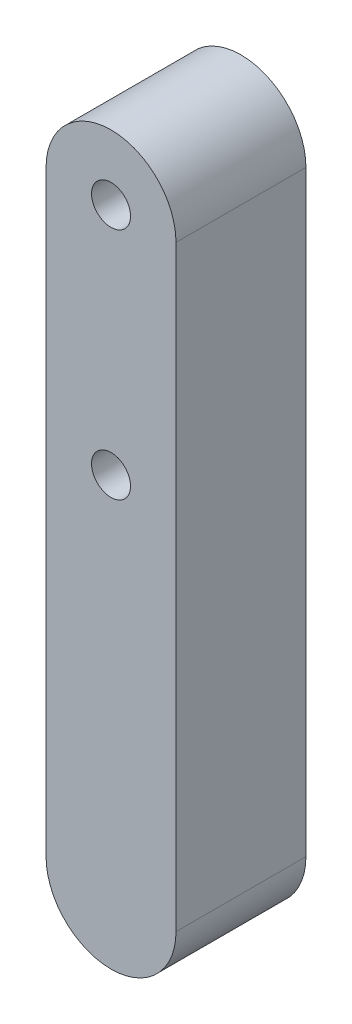
ISO-10303-21;
HEADER;
FILE_DESCRIPTION(('STEP AP214'),'2;1');
FILE_NAME('part.step','',(''),(''),'','','');
FILE_SCHEMA(('AUTOMOTIVE_DESIGN { 1 0 10303 214 1 1 1 1 }'));
ENDSEC;
DATA;
#1=APPLICATION_CONTEXT('core data for automotive mechanical design processes');
#2=APPLICATION_PROTOCOL_DEFINITION('international standard','automotive_design',2000,#1);
#3=PRODUCT_CONTEXT('',#1,'mechanical');
#4=PRODUCT('Part','Part','',(#3));
#5=PRODUCT_RELATED_PRODUCT_CATEGORY('part','',(#4));
#6=PRODUCT_DEFINITION_FORMATION('','',#4);
#7=PRODUCT_DEFINITION_CONTEXT('part definition',#1,'design');
#8=PRODUCT_DEFINITION('design','',#6,#7);
#9=PRODUCT_DEFINITION_SHAPE('','',#8);
#10=(LENGTH_UNIT() NAMED_UNIT(*) SI_UNIT(.MILLI.,.METRE.));
#11=(NAMED_UNIT(*) PLANE_ANGLE_UNIT() SI_UNIT($,.RADIAN.));
#12=(NAMED_UNIT(*) SI_UNIT($,.STERADIAN.) SOLID_ANGLE_UNIT());
#13=UNCERTAINTY_MEASURE_WITH_UNIT(LENGTH_MEASURE(1.E-05),#10,'distance_accuracy_value','');
#14=(GEOMETRIC_REPRESENTATION_CONTEXT(3) GLOBAL_UNCERTAINTY_ASSIGNED_CONTEXT((#13)) GLOBAL_UNIT_ASSIGNED_CONTEXT((#10,
#11,#12)) REPRESENTATION_CONTEXT('',''));
#15=CARTESIAN_POINT('',(0.,0.,0.));
#16=DIRECTION('',(0.,0.,1.));
#17=DIRECTION('',(1.,0.,0.));
#18=AXIS2_PLACEMENT_3D('',#15,#16,#17);
#19=CARTESIAN_POINT('',(0.,18.,-20.));
#20=DIRECTION('',(0.,0.,-1.));
#21=DIRECTION('',(-1.,0.,0.));
#22=AXIS2_PLACEMENT_3D('',#19,#20,#21);
#23=PLANE('',#22);
#24=CARTESIAN_POINT('',(0.,18.,-20.));
#25=DIRECTION('',(0.,0.,-1.));
#26=DIRECTION('',(-1.,0.,0.));
#27=AXIS2_PLACEMENT_3D('',#24,#25,#26);
#28=CIRCLE('',#27,3.);
#29=CARTESIAN_POINT('',(-2.99999999999999,18.,-20.));
#30=VERTEX_POINT('',#29);
#31=EDGE_CURVE('E99',#30,#30,#28,.T.);
#32=ORIENTED_EDGE('',*,*,#31,.F.);
#33=EDGE_LOOP('',(#32));
#34=FACE_BOUND('',#33,.T.);
#35=CARTESIAN_POINT('',(0.,18.,-20.));
#36=DIRECTION('',(0.,0.,-1.));
#37=DIRECTION('',(-1.,0.,0.));
#38=AXIS2_PLACEMENT_3D('',#35,#36,#37);
#39=CIRCLE('',#38,10.);
#40=CARTESIAN_POINT('',(-10.,18.,-20.));
#41=VERTEX_POINT('',#40);
#42=CARTESIAN_POINT('',(10.,18.,-20.));
#43=VERTEX_POINT('',#42);
#44=EDGE_CURVE('E84',#41,#43,#39,.T.);
#45=ORIENTED_EDGE('',*,*,#44,.T.);
#46=DIRECTION('',(0.,-1.,0.));
#47=VECTOR('',#46,1.);
#48=CARTESIAN_POINT('',(10.,18.,-20.));
#49=LINE('',#48,#47);
#50=CARTESIAN_POINT('',(10.,-73.8773209467205,-20.));
#51=VERTEX_POINT('',#50);
#52=EDGE_CURVE('E79',#43,#51,#49,.T.);
#53=ORIENTED_EDGE('',*,*,#52,.T.);
#54=CARTESIAN_POINT('',(0.,-73.8773209467205,-20.));
#55=DIRECTION('',(0.,0.,-1.));
#56=DIRECTION('',(-1.,0.,0.));
#57=AXIS2_PLACEMENT_3D('',#54,#55,#56);
#58=CIRCLE('',#57,10.);
#59=CARTESIAN_POINT('',(-10.,-73.8773209467205,-20.));
#60=VERTEX_POINT('',#59);
#61=EDGE_CURVE('E82',#51,#60,#58,.T.);
#62=ORIENTED_EDGE('',*,*,#61,.T.);
#63=DIRECTION('',(0.,1.,0.));
#64=VECTOR('',#63,1.);
#65=CARTESIAN_POINT('',(-10.,18.,-20.));
#66=LINE('',#65,#64);
#67=EDGE_CURVE('E49',#60,#41,#66,.T.);
#68=ORIENTED_EDGE('',*,*,#67,.T.);
#69=EDGE_LOOP('',(#45,#53,#62,#68));
#70=FACE_BOUND('',#69,.T.);
#71=CARTESIAN_POINT('',(0.,-18.,-20.));
#72=DIRECTION('',(0.,0.,-1.));
#73=DIRECTION('',(-1.,0.,0.));
#74=AXIS2_PLACEMENT_3D('',#71,#72,#73);
#75=CIRCLE('',#74,3.);
#76=CARTESIAN_POINT('',(-3.,-18.,-20.));
#77=VERTEX_POINT('',#76);
#78=EDGE_CURVE('E114',#77,#77,#75,.T.);
#79=ORIENTED_EDGE('',*,*,#78,.F.);
#80=EDGE_LOOP('',(#79));
#81=FACE_BOUND('',#80,.T.);
#82=ADVANCED_FACE('F32',(#34,#70,#81),#23,.T.);
#83=CARTESIAN_POINT('',(0.,18.,0.));
#84=DIRECTION('',(0.,0.,-1.));
#85=DIRECTION('',(-1.,0.,0.));
#86=AXIS2_PLACEMENT_3D('',#83,#84,#85);
#87=PLANE('',#86);
#88=CARTESIAN_POINT('',(0.,18.,0.));
#89=DIRECTION('',(0.,0.,-1.));
#90=DIRECTION('',(-1.,0.,0.));
#91=AXIS2_PLACEMENT_3D('',#88,#89,#90);
#92=CIRCLE('',#91,10.);
#93=CARTESIAN_POINT('',(-10.,18.,0.));
#94=VERTEX_POINT('',#93);
#95=CARTESIAN_POINT('',(10.,18.,0.));
#96=VERTEX_POINT('',#95);
#97=EDGE_CURVE('E96',#94,#96,#92,.T.);
#98=ORIENTED_EDGE('',*,*,#97,.F.);
#99=DIRECTION('',(0.,1.,0.));
#100=VECTOR('',#99,1.);
#101=CARTESIAN_POINT('',(-10.,18.,0.));
#102=LINE('',#101,#100);
#103=CARTESIAN_POINT('',(-10.,-73.8773209467205,0.));
#104=VERTEX_POINT('',#103);
#105=EDGE_CURVE('E72',#104,#94,#102,.T.);
#106=ORIENTED_EDGE('',*,*,#105,.F.);
#107=CARTESIAN_POINT('',(0.,-73.8773209467205,0.));
#108=DIRECTION('',(0.,0.,-1.));
#109=DIRECTION('',(-1.,0.,0.));
#110=AXIS2_PLACEMENT_3D('',#107,#108,#109);
#111=CIRCLE('',#110,10.);
#112=CARTESIAN_POINT('',(10.,-73.8773209467205,0.));
#113=VERTEX_POINT('',#112);
#114=EDGE_CURVE('E66',#113,#104,#111,.T.);
#115=ORIENTED_EDGE('',*,*,#114,.F.);
#116=DIRECTION('',(0.,-1.,0.));
#117=VECTOR('',#116,1.);
#118=CARTESIAN_POINT('',(10.,18.,0.));
#119=LINE('',#118,#117);
#120=EDGE_CURVE('E88',#96,#113,#119,.T.);
#121=ORIENTED_EDGE('',*,*,#120,.F.);
#122=EDGE_LOOP('',(#98,#106,#115,#121));
#123=FACE_BOUND('',#122,.T.);
#124=CARTESIAN_POINT('',(0.,18.,0.));
#125=DIRECTION('',(0.,0.,-1.));
#126=DIRECTION('',(-1.,0.,0.));
#127=AXIS2_PLACEMENT_3D('',#124,#125,#126);
#128=CIRCLE('',#127,3.);
#129=CARTESIAN_POINT('',(-2.99999999999999,18.,0.));
#130=VERTEX_POINT('',#129);
#131=EDGE_CURVE('E111',#130,#130,#128,.T.);
#132=ORIENTED_EDGE('',*,*,#131,.T.);
#133=EDGE_LOOP('',(#132));
#134=FACE_BOUND('',#133,.T.);
#135=CARTESIAN_POINT('',(0.,-18.,0.));
#136=DIRECTION('',(0.,0.,-1.));
#137=DIRECTION('',(-1.,0.,0.));
#138=AXIS2_PLACEMENT_3D('',#135,#136,#137);
#139=CIRCLE('',#138,3.);
#140=CARTESIAN_POINT('',(-3.,-18.,0.));
#141=VERTEX_POINT('',#140);
#142=EDGE_CURVE('E117',#141,#141,#139,.T.);
#143=ORIENTED_EDGE('',*,*,#142,.T.);
#144=EDGE_LOOP('',(#143));
#145=FACE_BOUND('',#144,.T.);
#146=ADVANCED_FACE('F107',(#123,#134,#145),#87,.F.);
#147=CARTESIAN_POINT('',(0.,18.,-20.));
#148=DIRECTION('',(0.,0.,1.));
#149=DIRECTION('',(1.,0.,0.));
#150=AXIS2_PLACEMENT_3D('',#147,#148,#149);
#151=CYLINDRICAL_SURFACE('',#150,10.);
#152=ORIENTED_EDGE('',*,*,#97,.T.);
#153=DIRECTION('',(0.,0.,1.));
#154=VECTOR('',#153,1.);
#155=CARTESIAN_POINT('',(10.,18.,-20.));
#156=LINE('',#155,#154);
#157=EDGE_CURVE('E11',#43,#96,#156,.T.);
#158=ORIENTED_EDGE('',*,*,#157,.F.);
#159=ORIENTED_EDGE('',*,*,#44,.F.);
#160=DIRECTION('',(0.,0.,1.));
#161=VECTOR('',#160,1.);
#162=CARTESIAN_POINT('',(-10.,18.,-20.));
#163=LINE('',#162,#161);
#164=EDGE_CURVE('E92',#41,#94,#163,.T.);
#165=ORIENTED_EDGE('',*,*,#164,.T.);
#166=EDGE_LOOP('',(#152,#158,#159,#165));
#167=FACE_BOUND('',#166,.T.);
#168=ADVANCED_FACE('F34',(#167),#151,.T.);
#169=CARTESIAN_POINT('',(10.,18.,-20.));
#170=DIRECTION('',(-1.,0.,0.));
#171=DIRECTION('',(0.,-1.,0.));
#172=AXIS2_PLACEMENT_3D('',#169,#170,#171);
#173=PLANE('',#172);
#174=ORIENTED_EDGE('',*,*,#120,.T.);
#175=DIRECTION('',(0.,0.,1.));
#176=VECTOR('',#175,1.);
#177=CARTESIAN_POINT('',(10.,-73.8773209467205,-20.));
#178=LINE('',#177,#176);
#179=EDGE_CURVE('E41',#51,#113,#178,.T.);
#180=ORIENTED_EDGE('',*,*,#179,.F.);
#181=ORIENTED_EDGE('',*,*,#52,.F.);
#182=ORIENTED_EDGE('',*,*,#157,.T.);
#183=EDGE_LOOP('',(#174,#180,#181,#182));
#184=FACE_BOUND('',#183,.T.);
#185=ADVANCED_FACE('F87',(#184),#173,.F.);
#186=CARTESIAN_POINT('',(0.,-73.8773209467205,-20.));
#187=DIRECTION('',(0.,0.,1.));
#188=DIRECTION('',(1.,0.,0.));
#189=AXIS2_PLACEMENT_3D('',#186,#187,#188);
#190=CYLINDRICAL_SURFACE('',#189,10.);
#191=ORIENTED_EDGE('',*,*,#114,.T.);
#192=DIRECTION('',(0.,0.,1.));
#193=VECTOR('',#192,1.);
#194=CARTESIAN_POINT('',(-10.,-73.8773209467205,-20.));
#195=LINE('',#194,#193);
#196=EDGE_CURVE('E89',#60,#104,#195,.T.);
#197=ORIENTED_EDGE('',*,*,#196,.F.);
#198=ORIENTED_EDGE('',*,*,#61,.F.);
#199=ORIENTED_EDGE('',*,*,#179,.T.);
#200=EDGE_LOOP('',(#191,#197,#198,#199));
#201=FACE_BOUND('',#200,.T.);
#202=ADVANCED_FACE('F90',(#201),#190,.T.);
#203=CARTESIAN_POINT('',(-10.,18.,-20.));
#204=DIRECTION('',(1.,0.,0.));
#205=DIRECTION('',(0.,1.,0.));
#206=AXIS2_PLACEMENT_3D('',#203,#204,#205);
#207=PLANE('',#206);
#208=ORIENTED_EDGE('',*,*,#105,.T.);
#209=ORIENTED_EDGE('',*,*,#164,.F.);
#210=ORIENTED_EDGE('',*,*,#67,.F.);
#211=ORIENTED_EDGE('',*,*,#196,.T.);
#212=EDGE_LOOP('',(#208,#209,#210,#211));
#213=FACE_BOUND('',#212,.T.);
#214=ADVANCED_FACE('F104',(#213),#207,.F.);
#215=CARTESIAN_POINT('',(0.,18.,-20.));
#216=DIRECTION('',(0.,0.,1.));
#217=DIRECTION('',(1.,0.,0.));
#218=AXIS2_PLACEMENT_3D('',#215,#216,#217);
#219=CYLINDRICAL_SURFACE('',#218,3.);
#220=ORIENTED_EDGE('',*,*,#31,.T.);
#221=EDGE_LOOP('',(#220));
#222=FACE_BOUND('',#221,.T.);
#223=ORIENTED_EDGE('',*,*,#131,.F.);
#224=EDGE_LOOP('',(#223));
#225=FACE_BOUND('',#224,.T.);
#226=ADVANCED_FACE('F134',(#222,#225),#219,.F.);
#227=CARTESIAN_POINT('',(0.,-18.,-20.));
#228=DIRECTION('',(0.,0.,1.));
#229=DIRECTION('',(1.,0.,0.));
#230=AXIS2_PLACEMENT_3D('',#227,#228,#229);
#231=CYLINDRICAL_SURFACE('',#230,3.);
#232=ORIENTED_EDGE('',*,*,#78,.T.);
#233=EDGE_LOOP('',(#232));
#234=FACE_BOUND('',#233,.T.);
#235=ORIENTED_EDGE('',*,*,#142,.F.);
#236=EDGE_LOOP('',(#235));
#237=FACE_BOUND('',#236,.T.);
#238=ADVANCED_FACE('F123',(#234,#237),#231,.F.);
#239=CLOSED_SHELL('',(#82,#146,#168,#185,#202,#214,#226,#238));
#240=MANIFOLD_SOLID_BREP('B2',#239);
#241=ADVANCED_BREP_SHAPE_REPRESENTATION('',(#18,#240),#14);
#242=SHAPE_DEFINITION_REPRESENTATION(#9,#241);
ENDSEC;
END-ISO-10303-21;
